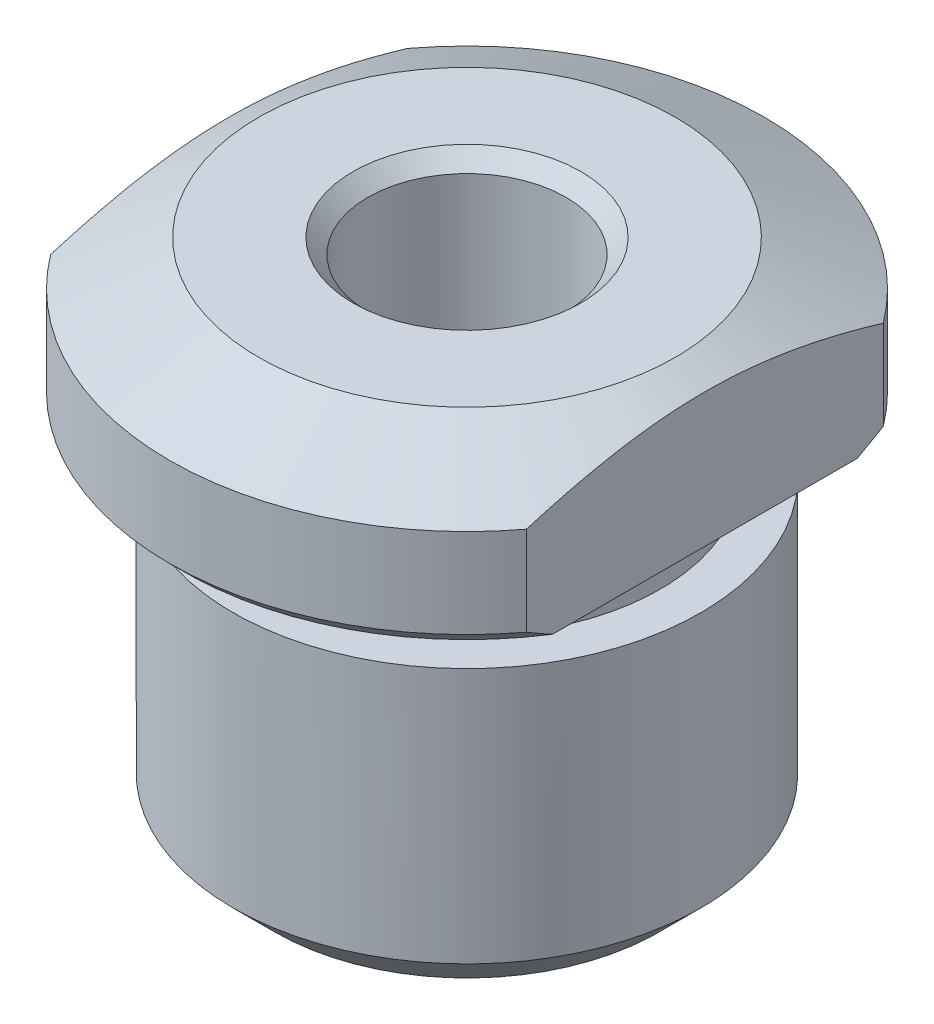
ISO-10303-21;
HEADER;
FILE_DESCRIPTION(('STEP AP214'),'2;1');
FILE_NAME('part.step','',(''),(''),'','','');
FILE_SCHEMA(('AUTOMOTIVE_DESIGN { 1 0 10303 214 1 1 1 1 }'));
ENDSEC;
DATA;
#1=APPLICATION_CONTEXT('core data for automotive mechanical design processes');
#2=APPLICATION_PROTOCOL_DEFINITION('international standard','automotive_design',2000,#1);
#3=PRODUCT_CONTEXT('',#1,'mechanical');
#4=PRODUCT('Part','Part','',(#3));
#5=PRODUCT_RELATED_PRODUCT_CATEGORY('part','',(#4));
#6=PRODUCT_DEFINITION_FORMATION('','',#4);
#7=PRODUCT_DEFINITION_CONTEXT('part definition',#1,'design');
#8=PRODUCT_DEFINITION('design','',#6,#7);
#9=PRODUCT_DEFINITION_SHAPE('','',#8);
#10=(LENGTH_UNIT() NAMED_UNIT(*) SI_UNIT(.MILLI.,.METRE.));
#11=(NAMED_UNIT(*) PLANE_ANGLE_UNIT() SI_UNIT($,.RADIAN.));
#12=(NAMED_UNIT(*) SI_UNIT($,.STERADIAN.) SOLID_ANGLE_UNIT());
#13=UNCERTAINTY_MEASURE_WITH_UNIT(LENGTH_MEASURE(1.E-05),#10,'distance_accuracy_value','');
#14=(GEOMETRIC_REPRESENTATION_CONTEXT(3) GLOBAL_UNCERTAINTY_ASSIGNED_CONTEXT((#13)) GLOBAL_UNIT_ASSIGNED_CONTEXT((#10,
#11,#12)) REPRESENTATION_CONTEXT('',''));
#15=CARTESIAN_POINT('',(0.,0.,0.));
#16=DIRECTION('',(0.,0.,1.));
#17=DIRECTION('',(1.,0.,0.));
#18=AXIS2_PLACEMENT_3D('',#15,#16,#17);
#19=CARTESIAN_POINT('',(3.5,8.5,0.));
#20=DIRECTION('',(0.,1.,0.));
#21=DIRECTION('',(0.,0.,1.));
#22=AXIS2_PLACEMENT_3D('',#19,#20,#21);
#23=PLANE('',#22);
#24=CARTESIAN_POINT('',(0.,8.49999999996953,0.));
#25=DIRECTION('',(0.,1.,0.));
#26=DIRECTION('',(0.,0.,1.));
#27=AXIS2_PLACEMENT_3D('',#24,#25,#26);
#28=CIRCLE('',#27,1.91599999999426);
#29=CARTESIAN_POINT('',(0.,8.49999999996953,1.91599999999426));
#30=VERTEX_POINT('',#29);
#31=EDGE_CURVE('E188',#30,#30,#28,.F.);
#32=ORIENTED_EDGE('',*,*,#31,.T.);
#33=EDGE_LOOP('',(#32));
#34=FACE_BOUND('',#33,.T.);
#35=CARTESIAN_POINT('',(0.,8.49999999996953,0.));
#36=DIRECTION('',(0.,-1.,0.));
#37=DIRECTION('',(0.,0.,-1.));
#38=AXIS2_PLACEMENT_3D('',#35,#36,#37);
#39=CIRCLE('',#38,3.50000000008777);
#40=CARTESIAN_POINT('',(0.,8.49999999996953,-3.50000000008777));
#41=VERTEX_POINT('',#40);
#42=EDGE_CURVE('E19',#41,#41,#39,.T.);
#43=ORIENTED_EDGE('',*,*,#42,.F.);
#44=EDGE_LOOP('',(#43));
#45=FACE_BOUND('',#44,.T.);
#46=ADVANCED_FACE('F16',(#34,#45),#23,.T.);
#47=CARTESIAN_POINT('',(0.,6.875,0.));
#48=DIRECTION('',(0.,-1.,0.));
#49=DIRECTION('',(0.,0.,-1.));
#50=AXIS2_PLACEMENT_3D('',#47,#48,#49);
#51=CYLINDRICAL_SURFACE('',#50,5.);
#52=CARTESIAN_POINT('',(0.,7.75000000001569,0.));
#53=DIRECTION('',(0.,-1.,0.));
#54=DIRECTION('',(1.,0.,0.));
#55=AXIS2_PLACEMENT_3D('',#52,#53,#54);
#56=CIRCLE('',#55,4.99999999999545);
#57=CARTESIAN_POINT('',(-4.,7.75000000002876,2.99999999999621));
#58=VERTEX_POINT('',#57);
#59=CARTESIAN_POINT('',(4.,7.75000000002876,2.99999999999621));
#60=VERTEX_POINT('',#59);
#61=EDGE_CURVE('E92',#58,#60,#56,.F.);
#62=ORIENTED_EDGE('',*,*,#61,.F.);
#63=DIRECTION('',(0.,-1.,0.));
#64=VECTOR('',#63,1.);
#65=CARTESIAN_POINT('',(-4.,6.875,3.));
#66=LINE('',#65,#64);
#67=CARTESIAN_POINT('',(-3.99999999999818,6.24999999991133,2.99999999999863));
#68=VERTEX_POINT('',#67);
#69=EDGE_CURVE('E63',#58,#68,#66,.T.);
#70=ORIENTED_EDGE('',*,*,#69,.T.);
#71=CARTESIAN_POINT('',(0.,6.24999999990905,0.));
#72=DIRECTION('',(0.,1.,0.));
#73=DIRECTION('',(1.,0.,0.));
#74=AXIS2_PLACEMENT_3D('',#71,#72,#73);
#75=CIRCLE('',#74,4.99999999999545);
#76=CARTESIAN_POINT('',(3.99999999999818,6.24999999991133,2.99999999999864));
#77=VERTEX_POINT('',#76);
#78=EDGE_CURVE('E84',#77,#68,#75,.F.);
#79=ORIENTED_EDGE('',*,*,#78,.F.);
#80=DIRECTION('',(0.,-1.,0.));
#81=VECTOR('',#80,1.);
#82=CARTESIAN_POINT('',(4.,6.875,3.));
#83=LINE('',#82,#81);
#84=EDGE_CURVE('E180',#77,#60,#83,.F.);
#85=ORIENTED_EDGE('',*,*,#84,.T.);
#86=EDGE_LOOP('',(#62,#70,#79,#85));
#87=FACE_BOUND('',#86,.T.);
#88=ADVANCED_FACE('F184',(#87),#51,.T.);
#89=CARTESIAN_POINT('',(0.,6.875,0.));
#90=DIRECTION('',(0.,-1.,0.));
#91=DIRECTION('',(0.,0.,-1.));
#92=AXIS2_PLACEMENT_3D('',#89,#90,#91);
#93=CYLINDRICAL_SURFACE('',#92,5.);
#94=CARTESIAN_POINT('',(0.,7.75000000001569,0.));
#95=DIRECTION('',(0.,-1.,0.));
#96=DIRECTION('',(1.,0.,0.));
#97=AXIS2_PLACEMENT_3D('',#94,#95,#96);
#98=CIRCLE('',#97,4.99999999999545);
#99=CARTESIAN_POINT('',(4.,7.75000000002876,-2.99999999999621));
#100=VERTEX_POINT('',#99);
#101=CARTESIAN_POINT('',(-4.,7.75000000002876,-2.99999999999621));
#102=VERTEX_POINT('',#101);
#103=EDGE_CURVE('E80',#100,#102,#98,.F.);
#104=ORIENTED_EDGE('',*,*,#103,.F.);
#105=DIRECTION('',(0.,-1.,0.));
#106=VECTOR('',#105,1.);
#107=CARTESIAN_POINT('',(4.,6.875,-3.));
#108=LINE('',#107,#106);
#109=CARTESIAN_POINT('',(3.99999999999818,6.24999999991133,-2.99999999999864));
#110=VERTEX_POINT('',#109);
#111=EDGE_CURVE('E89',#100,#110,#108,.T.);
#112=ORIENTED_EDGE('',*,*,#111,.T.);
#113=CARTESIAN_POINT('',(0.,6.24999999990905,0.));
#114=DIRECTION('',(0.,1.,0.));
#115=DIRECTION('',(1.,0.,0.));
#116=AXIS2_PLACEMENT_3D('',#113,#114,#115);
#117=CIRCLE('',#116,4.99999999999545);
#118=CARTESIAN_POINT('',(-3.99999999999818,6.24999999991133,-2.99999999999864));
#119=VERTEX_POINT('',#118);
#120=EDGE_CURVE('E82',#119,#110,#117,.F.);
#121=ORIENTED_EDGE('',*,*,#120,.F.);
#122=DIRECTION('',(0.,1.,0.));
#123=VECTOR('',#122,1.);
#124=CARTESIAN_POINT('',(-4.,8.5,-3.));
#125=LINE('',#124,#123);
#126=EDGE_CURVE('E69',#119,#102,#125,.T.);
#127=ORIENTED_EDGE('',*,*,#126,.T.);
#128=EDGE_LOOP('',(#104,#112,#121,#127));
#129=FACE_BOUND('',#128,.T.);
#130=ADVANCED_FACE('F78',(#129),#93,.T.);
#131=CARTESIAN_POINT('',(0.,7.75000000012938,0.));
#132=DIRECTION('',(0.,-1.,0.));
#133=DIRECTION('',(0.,0.,-1.));
#134=AXIS2_PLACEMENT_3D('',#131,#132,#133);
#135=CONICAL_SURFACE('',#134,4.99999999982492,1.10714871780925);
#136=ORIENTED_EDGE('',*,*,#42,.T.);
#137=EDGE_LOOP('',(#136));
#138=FACE_BOUND('',#137,.T.);
#139=ORIENTED_EDGE('',*,*,#61,.T.);
#140=CARTESIAN_POINT('',(4.,7.75000000003889,3.00000000000981));
#141=CARTESIAN_POINT('',(4.,7.79491387910037,2.85021935650481));
#142=CARTESIAN_POINT('',(4.,7.83789774873525,2.69982773216329));
#143=CARTESIAN_POINT('',(4.,7.91909856737556,2.39765556200096));
#144=CARTESIAN_POINT('',(4.,7.95731217030268,2.24587412051542));
#145=CARTESIAN_POINT('',(4.,8.02813930030492,1.94036449033213));
#146=CARTESIAN_POINT('',(4.,8.06073020936781,1.78663099267658));
#147=CARTESIAN_POINT('',(4.,8.11905342078394,1.47788703232964));
#148=CARTESIAN_POINT('',(4.,8.14478717362019,1.32287684685702));
#149=CARTESIAN_POINT('',(4.,8.1876823481098,1.01662399193388));
#150=CARTESIAN_POINT('',(4.,8.20508762998914,0.865415909072663));
#151=CARTESIAN_POINT('',(4.,8.23171542257041,0.56226673629436));
#152=CARTESIAN_POINT('',(4.,8.24093776512542,0.410325631379287));
#153=CARTESIAN_POINT('',(4.,8.25072427466178,0.106484775656386));
#154=CARTESIAN_POINT('',(4.,8.25130691579384,-0.0454143686751014));
#155=CARTESIAN_POINT('',(4.,8.24383512279487,-0.348982846789214));
#156=CARTESIAN_POINT('',(4.,8.23578125441728,-0.500652194973413));
#157=CARTESIAN_POINT('',(4.,8.20774356729911,-0.849158565101071));
#158=CARTESIAN_POINT('',(4.,8.18488577596153,-1.04576595544764));
#159=CARTESIAN_POINT('',(4.,8.12686623804992,-1.43731378677869));
#160=CARTESIAN_POINT('',(4.,8.09169168340674,-1.63225227527116));
#161=CARTESIAN_POINT('',(4.,8.01030918904255,-2.02419428553192));
#162=CARTESIAN_POINT('',(4.,7.96387858921217,-2.22115095905438));
#163=CARTESIAN_POINT('',(4.,7.88797064599536,-2.51470042351474));
#164=CARTESIAN_POINT('',(4.,7.86165634644429,-2.61213100309075));
#165=CARTESIAN_POINT('',(4.,7.80716669455936,-2.80645582780513));
#166=CARTESIAN_POINT('',(4.,7.77899161367512,-2.90335014894727));
#167=CARTESIAN_POINT('',(4.,7.75000000003889,-3.00000000000981));
#168=B_SPLINE_CURVE_WITH_KNOTS('',3,(#140,#141,#142,#143,#144,#145,#146,#147,#148,#149,#150,
#151,#152,#153,#154,#155,#156,#157,#158,#159,#160,#161,#162,#163,#164,#165,#166,#167),
.UNSPECIFIED.,.F.,.F.,(4,2,2,2,2,2,2,2,2,2,2,2,2,4),(0.,0.469142516963251,0.938612284087086,
1.40992861959039,1.88114517903748,2.33756137387622,2.79398694715405,3.24943641103924,
3.70485604153327,4.29817837779961,4.89211954489016,5.49893667869567,5.80168716653266,
6.10439358645555),.UNSPECIFIED.);
#169=EDGE_CURVE('E88',#60,#100,#168,.T.);
#170=ORIENTED_EDGE('',*,*,#169,.T.);
#171=ORIENTED_EDGE('',*,*,#103,.T.);
#172=CARTESIAN_POINT('',(-4.,7.75000000003889,-3.00000000000981));
#173=CARTESIAN_POINT('',(-4.,7.78694228888786,-2.87682334174033));
#174=CARTESIAN_POINT('',(-4.,7.82256593788984,-2.75325701851357));
#175=CARTESIAN_POINT('',(-4.,7.89069174720551,-2.50522260972994));
#176=CARTESIAN_POINT('',(-4.,7.92319281262515,-2.38075422420905));
#177=CARTESIAN_POINT('',(-4.,8.01546166788762,-2.00507052461318));
#178=CARTESIAN_POINT('',(-4.,8.06973040827052,-1.75243474662128));
#179=CARTESIAN_POINT('',(-4.,8.1360293926393,-1.37437723268489));
#180=CARTESIAN_POINT('',(-4.,8.15544089243393,-1.25023203806286));
#181=CARTESIAN_POINT('',(-4.,8.18916498930599,-1.00125660639436));
#182=CARTESIAN_POINT('',(-4.,8.20347825886983,-0.876426461904105));
#183=CARTESIAN_POINT('',(-4.,8.22654980461186,-0.626466193063438));
#184=CARTESIAN_POINT('',(-4.,8.23531758146342,-0.501336952443553));
#185=CARTESIAN_POINT('',(-4.,8.24704263493093,-0.250805138421694));
#186=CARTESIAN_POINT('',(-4.,8.25000000002289,-0.125402569210847));
#187=CARTESIAN_POINT('',(-4.,8.25000000002289,0.125402569210848));
#188=CARTESIAN_POINT('',(-4.,8.24704263493093,0.250805138421695));
#189=CARTESIAN_POINT('',(-4.,8.23531758146342,0.501336952443553));
#190=CARTESIAN_POINT('',(-4.,8.22654980461186,0.626466193063439));
#191=CARTESIAN_POINT('',(-4.,8.20347825886982,0.876426461904106));
#192=CARTESIAN_POINT('',(-4.,8.18916498930599,1.00125660639436));
#193=CARTESIAN_POINT('',(-4.,8.15544089243392,1.25023203806287));
#194=CARTESIAN_POINT('',(-4.,8.13602939263929,1.37437723268489));
#195=CARTESIAN_POINT('',(-4.,8.06973040827052,1.75243474662128));
#196=CARTESIAN_POINT('',(-4.,8.01546166788762,2.00507052461318));
#197=CARTESIAN_POINT('',(-4.,7.92319281262515,2.38075422420905));
#198=CARTESIAN_POINT('',(-4.,7.89069174720551,2.50522260972994));
#199=CARTESIAN_POINT('',(-4.,7.82256593788984,2.75325701851357));
#200=CARTESIAN_POINT('',(-4.,7.78694228888786,2.87682334174033));
#201=CARTESIAN_POINT('',(-4.,7.75000000003889,3.00000000000981));
#202=B_SPLINE_CURVE_WITH_KNOTS('',3,(#172,#173,#174,#175,#176,#177,#178,#179,#180,#181,#182,
#183,#184,#185,#186,#187,#188,#189,#190,#191,#192,#193,#194,#195,#196,#197,#198,#199,#200,#201),
.UNSPECIFIED.,.F.,.F.,(4,2,2,2,2,2,2,2,2,2,2,2,2,2,4),(0.,0.385766115623825,0.771667005293371,
1.54615966329038,1.92303597382833,2.29986255374942,2.67604178388624,3.05221528584135,
3.42838878779647,3.80456801793328,4.18139459785437,4.55827090839232,5.33276356638933,
5.71866445605888,6.1044305716827),.UNSPECIFIED.);
#203=EDGE_CURVE('E66',#102,#58,#202,.T.);
#204=ORIENTED_EDGE('',*,*,#203,.T.);
#205=EDGE_LOOP('',(#139,#170,#171,#204));
#206=FACE_BOUND('',#205,.T.);
#207=ADVANCED_FACE('F86',(#138,#206),#135,.T.);
#208=CARTESIAN_POINT('',(0.,8.49999999996953,0.));
#209=DIRECTION('',(0.,1.,0.));
#210=DIRECTION('',(0.,0.,1.));
#211=AXIS2_PLACEMENT_3D('',#208,#209,#210);
#212=CONICAL_SURFACE('',#211,1.91599999999426,0.785398163283761);
#213=CARTESIAN_POINT('',(0.,8.25,0.));
#214=DIRECTION('',(0.,-1.,0.));
#215=DIRECTION('',(0.,0.,-1.));
#216=AXIS2_PLACEMENT_3D('',#213,#214,#215);
#217=CIRCLE('',#216,1.666);
#218=CARTESIAN_POINT('',(0.,8.25,-1.666));
#219=VERTEX_POINT('',#218);
#220=EDGE_CURVE('E131',#219,#219,#217,.T.);
#221=ORIENTED_EDGE('',*,*,#220,.T.);
#222=EDGE_LOOP('',(#221));
#223=FACE_BOUND('',#222,.T.);
#224=ORIENTED_EDGE('',*,*,#31,.F.);
#225=EDGE_LOOP('',(#224));
#226=FACE_BOUND('',#225,.T.);
#227=ADVANCED_FACE('F141',(#223,#226),#212,.F.);
#228=CARTESIAN_POINT('',(0.,6.24999999990905,0.));
#229=DIRECTION('',(0.,1.,0.));
#230=DIRECTION('',(0.,0.,1.));
#231=AXIS2_PLACEMENT_3D('',#228,#229,#230);
#232=CONICAL_SURFACE('',#231,4.99999999999545,0.785398163397448);
#233=CARTESIAN_POINT('',(4.00000000003638,5.9999999999568,2.5617376915132));
#234=CARTESIAN_POINT('',(4.00000000143742,6.00972162154321,2.57976357906766));
#235=CARTESIAN_POINT('',(4.00000003164346,6.01949958778913,2.597759052207));
#236=CARTESIAN_POINT('',(4.00000011822165,6.03923737402845,2.63382291922614));
#237=CARTESIAN_POINT('',(4.00000017478543,6.04919800378297,2.65189086995705));
#238=CARTESIAN_POINT('',(4.00000028207004,6.06930109774479,2.68810142142043));
#239=CARTESIAN_POINT('',(4.00000033274426,6.07944436350451,2.70624357707125));
#240=CARTESIAN_POINT('',(4.00000040722288,6.09991274517778,2.7426042106637));
#241=CARTESIAN_POINT('',(4.00000043082314,6.11023865416713,2.76082224211374));
#242=CARTESIAN_POINT('',(4.00000044071544,6.13107232857173,2.79733624193925));
#243=CARTESIAN_POINT('',(4.00000042672496,6.141580878052,2.81563176289606));
#244=CARTESIAN_POINT('',(4.00000036507994,6.16277984512498,2.85230229965066));
#245=CARTESIAN_POINT('',(4.00000031717116,6.17347103741082,2.87067686755752));
#246=CARTESIAN_POINT('',(4.00000020587029,6.19503529218977,2.90750700154564));
#247=CARTESIAN_POINT('',(4.00000014236313,6.20590911958634,2.92596211969945));
#248=CARTESIAN_POINT('',(4.00000004099685,6.22783868225676,2.96295479873604));
#249=CARTESIAN_POINT('',(4.00000000333741,6.23889517262476,2.98149191202348));
#250=CARTESIAN_POINT('',(4.00000000003456,6.2499999999568,3.00000000002592));
#251=B_SPLINE_CURVE_WITH_KNOTS('',3,(#233,#234,#235,#236,#237,#238,#239,#240,#241,#242,#243,
#244,#245,#246,#247,#248,#249,#250),.UNSPECIFIED.,.F.,.F.,(4,2,2,2,2,2,2,2,4),(0.,
0.0614407552478923,0.12333532289982,0.185690498157925,0.248512831321725,0.311808633743947,
0.375583983804472,0.439844732886779,0.504596511342822),.UNSPECIFIED.);
#252=CARTESIAN_POINT('',(4.00000000001819,5.99999999993588,2.56173769150281));
#253=VERTEX_POINT('',#252);
#254=EDGE_CURVE('E121',#253,#77,#251,.T.);
#255=ORIENTED_EDGE('',*,*,#254,.T.);
#256=ORIENTED_EDGE('',*,*,#78,.T.);
#257=CARTESIAN_POINT('',(-4.00000000003456,6.2499999999568,3.00000000002592));
#258=CARTESIAN_POINT('',(-4.00000000333741,6.23889517262476,2.98149191202348));
#259=CARTESIAN_POINT('',(-4.00000004099685,6.22783868225676,2.96295479873604));
#260=CARTESIAN_POINT('',(-4.00000014236313,6.20590911958634,2.92596211969944));
#261=CARTESIAN_POINT('',(-4.0000002058703,6.19503529218976,2.90750700154563));
#262=CARTESIAN_POINT('',(-4.00000031717117,6.17347103741082,2.87067686755751));
#263=CARTESIAN_POINT('',(-4.00000036507994,6.16277984512498,2.85230229965065));
#264=CARTESIAN_POINT('',(-4.00000042672496,6.141580878052,2.81563176289605));
#265=CARTESIAN_POINT('',(-4.00000044071544,6.13107232857173,2.79733624193924));
#266=CARTESIAN_POINT('',(-4.00000043082314,6.11023865416713,2.76082224211374));
#267=CARTESIAN_POINT('',(-4.00000040722288,6.09991274517778,2.7426042106637));
#268=CARTESIAN_POINT('',(-4.00000033274426,6.07944436350451,2.70624357707125));
#269=CARTESIAN_POINT('',(-4.00000028207004,6.06930109774478,2.68810142142043));
#270=CARTESIAN_POINT('',(-4.00000017478543,6.04919800378297,2.65189086995705));
#271=CARTESIAN_POINT('',(-4.00000011822165,6.03923737402845,2.63382291922614));
#272=CARTESIAN_POINT('',(-4.00000003164345,6.01949958778913,2.597759052207));
#273=CARTESIAN_POINT('',(-4.00000000143742,6.00972162154321,2.57976357906766));
#274=CARTESIAN_POINT('',(-4.00000000003638,5.9999999999568,2.5617376915132));
#275=B_SPLINE_CURVE_WITH_KNOTS('',3,(#257,#258,#259,#260,#261,#262,#263,#264,#265,#266,#267,
#268,#269,#270,#271,#272,#273,#274),.UNSPECIFIED.,.F.,.F.,(4,2,2,2,2,2,2,2,4),(0.,
0.0647517784560482,0.129012527538358,0.192787877598882,0.256083680021102,0.318906013184901,
0.381261188443007,0.44315575609493,0.504596511342821),.UNSPECIFIED.);
#276=CARTESIAN_POINT('',(-4.00000000001819,5.99999999993588,2.56173769150281));
#277=VERTEX_POINT('',#276);
#278=EDGE_CURVE('E74',#68,#277,#275,.T.);
#279=ORIENTED_EDGE('',*,*,#278,.T.);
#280=CARTESIAN_POINT('',(0.,5.99999999991496,0.));
#281=DIRECTION('',(0.,1.,0.));
#282=DIRECTION('',(0.,0.,1.));
#283=AXIS2_PLACEMENT_3D('',#280,#281,#282);
#284=CIRCLE('',#283,4.75000000000136);
#285=EDGE_CURVE('E160',#253,#277,#284,.F.);
#286=ORIENTED_EDGE('',*,*,#285,.F.);
#287=EDGE_LOOP('',(#255,#256,#279,#286));
#288=FACE_BOUND('',#287,.T.);
#289=ADVANCED_FACE('F132',(#288),#232,.T.);
#290=CARTESIAN_POINT('',(-4.,8.5,-8.43013843384797));
#291=DIRECTION('',(1.,0.,0.));
#292=DIRECTION('',(0.,0.,-1.));
#293=AXIS2_PLACEMENT_3D('',#290,#291,#292);
#294=PLANE('',#293);
#295=ORIENTED_EDGE('',*,*,#69,.F.);
#296=ORIENTED_EDGE('',*,*,#203,.F.);
#297=ORIENTED_EDGE('',*,*,#126,.F.);
#298=CARTESIAN_POINT('',(-4.00000000000115,5.99999999991496,-2.56173769149064));
#299=CARTESIAN_POINT('',(-4.00000000140496,6.00972162150553,-2.57976357904847));
#300=CARTESIAN_POINT('',(-4.00000003161334,6.01949958775533,-2.59775905219132));
#301=CARTESIAN_POINT('',(-4.00000011819546,6.03923737400125,-2.63382291921645));
#302=CARTESIAN_POINT('',(-4.00000017476081,6.04919800375848,-2.65189086994986));
#303=CARTESIAN_POINT('',(-4.00000028204782,6.06930109772452,-2.68810142141717));
#304=CARTESIAN_POINT('',(-4.00000033272286,6.07944436348577,-2.70624357706943));
#305=CARTESIAN_POINT('',(-4.00000040720243,6.0999127451609,-2.74260421066369));
#306=CARTESIAN_POINT('',(-4.0000004308028,6.11023865415059,-2.7608222421141));
#307=CARTESIAN_POINT('',(-4.00000044069466,6.13107232855469,-2.79733624193923));
#308=CARTESIAN_POINT('',(-4.00000042670362,6.14158087803412,-2.81563176289531));
#309=CARTESIAN_POINT('',(-4.00000036505685,6.16277984510424,-2.8523022996473));
#310=CARTESIAN_POINT('',(-4.00000031714688,6.17347103738805,-2.8706768675523));
#311=CARTESIAN_POINT('',(-4.00000020584302,6.19503529216176,-2.90750700153553));
#312=CARTESIAN_POINT('',(-4.00000014233406,6.20590911955513,-2.92596211968633));
#313=CARTESIAN_POINT('',(-4.00000004096362,6.22783868221796,-2.96295479871569));
#314=CARTESIAN_POINT('',(-4.00000000330182,6.23889517258156,-2.98149191199893));
#315=CARTESIAN_POINT('',(-3.99999999999636,6.24999999990905,-2.99999999999727));
#316=B_SPLINE_CURVE_WITH_KNOTS('',3,(#298,#299,#300,#301,#302,#303,#304,#305,#306,#307,#308,
#309,#310,#311,#312,#313,#314,#315),.UNSPECIFIED.,.F.,.F.,(4,2,2,2,2,2,2,2,4),(0.,
0.0614407552627131,0.123335322925103,0.18569049818922,0.24851283135448,0.311808633773528,
0.375583983826164,0.439844732895784,0.504596511334258),.UNSPECIFIED.);
#317=CARTESIAN_POINT('',(-4.00000000000057,5.99999999991496,-2.56173769149153));
#318=VERTEX_POINT('',#317);
#319=EDGE_CURVE('E97',#318,#119,#316,.T.);
#320=ORIENTED_EDGE('',*,*,#319,.F.);
#321=DIRECTION('',(0.,0.,-1.));
#322=VECTOR('',#321,1.);
#323=CARTESIAN_POINT('',(-4.,6.,0.));
#324=LINE('',#323,#322);
#325=EDGE_CURVE('E163',#277,#318,#324,.T.);
#326=ORIENTED_EDGE('',*,*,#325,.F.);
#327=ORIENTED_EDGE('',*,*,#278,.F.);
#328=EDGE_LOOP('',(#295,#296,#297,#320,#326,#327));
#329=FACE_BOUND('',#328,.T.);
#330=ADVANCED_FACE('F68',(#329),#294,.F.);
#331=CARTESIAN_POINT('',(0.,6.24999999990905,0.));
#332=DIRECTION('',(0.,1.,0.));
#333=DIRECTION('',(0.,0.,1.));
#334=AXIS2_PLACEMENT_3D('',#331,#332,#333);
#335=CONICAL_SURFACE('',#334,4.99999999999545,0.785398163397448);
#336=ORIENTED_EDGE('',*,*,#319,.T.);
#337=ORIENTED_EDGE('',*,*,#120,.T.);
#338=CARTESIAN_POINT('',(4.00000000003456,6.2499999999568,-3.00000000002592));
#339=CARTESIAN_POINT('',(4.00000000333741,6.23889517262476,-2.98149191202348));
#340=CARTESIAN_POINT('',(4.00000004099685,6.22783868225676,-2.96295479873604));
#341=CARTESIAN_POINT('',(4.00000014236313,6.20590911958634,-2.92596211969945));
#342=CARTESIAN_POINT('',(4.0000002058703,6.19503529218977,-2.90750700154564));
#343=CARTESIAN_POINT('',(4.00000031717116,6.17347103741082,-2.87067686755752));
#344=CARTESIAN_POINT('',(4.00000036507994,6.16277984512498,-2.85230229965066));
#345=CARTESIAN_POINT('',(4.00000042672496,6.141580878052,-2.81563176289606));
#346=CARTESIAN_POINT('',(4.00000044071544,6.13107232857173,-2.79733624193925));
#347=CARTESIAN_POINT('',(4.00000043082314,6.11023865416713,-2.76082224211374));
#348=CARTESIAN_POINT('',(4.00000040722288,6.09991274517778,-2.7426042106637));
#349=CARTESIAN_POINT('',(4.00000033274426,6.07944436350451,-2.70624357707125));
#350=CARTESIAN_POINT('',(4.00000028207004,6.06930109774479,-2.68810142142044));
#351=CARTESIAN_POINT('',(4.00000017478543,6.04919800378297,-2.65189086995705));
#352=CARTESIAN_POINT('',(4.00000011822165,6.03923737402845,-2.63382291922614));
#353=CARTESIAN_POINT('',(4.00000003164346,6.01949958778913,-2.597759052207));
#354=CARTESIAN_POINT('',(4.00000000143742,6.00972162154322,-2.57976357906766));
#355=CARTESIAN_POINT('',(4.00000000003638,5.9999999999568,-2.5617376915132));
#356=B_SPLINE_CURVE_WITH_KNOTS('',3,(#338,#339,#340,#341,#342,#343,#344,#345,#346,#347,#348,
#349,#350,#351,#352,#353,#354,#355),.UNSPECIFIED.,.F.,.F.,(4,2,2,2,2,2,2,2,4),(0.,
0.0647517784560436,0.12901252753835,0.192787877598873,0.256083680021097,0.318906013184896,
0.381261188443001,0.44315575609493,0.504596511342822),.UNSPECIFIED.);
#357=CARTESIAN_POINT('',(4.00000000001819,5.99999999993588,-2.56173769150281));
#358=VERTEX_POINT('',#357);
#359=EDGE_CURVE('E34',#110,#358,#356,.T.);
#360=ORIENTED_EDGE('',*,*,#359,.T.);
#361=CARTESIAN_POINT('',(0.,5.99999999991496,0.));
#362=DIRECTION('',(0.,1.,0.));
#363=DIRECTION('',(0.,0.,1.));
#364=AXIS2_PLACEMENT_3D('',#361,#362,#363);
#365=CIRCLE('',#364,4.75000000000136);
#366=EDGE_CURVE('E164',#318,#358,#365,.F.);
#367=ORIENTED_EDGE('',*,*,#366,.F.);
#368=EDGE_LOOP('',(#336,#337,#360,#367));
#369=FACE_BOUND('',#368,.T.);
#370=ADVANCED_FACE('F104',(#369),#335,.T.);
#371=CARTESIAN_POINT('',(4.,8.5,8.43013843384797));
#372=DIRECTION('',(-1.,0.,0.));
#373=DIRECTION('',(0.,0.,1.));
#374=AXIS2_PLACEMENT_3D('',#371,#372,#373);
#375=PLANE('',#374);
#376=DIRECTION('',(0.,0.,-1.));
#377=VECTOR('',#376,1.);
#378=CARTESIAN_POINT('',(4.,6.,0.));
#379=LINE('',#378,#377);
#380=EDGE_CURVE('E167',#358,#253,#379,.F.);
#381=ORIENTED_EDGE('',*,*,#380,.F.);
#382=ORIENTED_EDGE('',*,*,#359,.F.);
#383=ORIENTED_EDGE('',*,*,#111,.F.);
#384=ORIENTED_EDGE('',*,*,#169,.F.);
#385=ORIENTED_EDGE('',*,*,#84,.F.);
#386=ORIENTED_EDGE('',*,*,#254,.F.);
#387=EDGE_LOOP('',(#381,#382,#383,#384,#385,#386));
#388=FACE_BOUND('',#387,.T.);
#389=ADVANCED_FACE('F114',(#388),#375,.F.);
#390=CARTESIAN_POINT('',(0.,3.5,0.));
#391=DIRECTION('',(0.,-1.,0.));
#392=DIRECTION('',(0.,0.,-1.));
#393=AXIS2_PLACEMENT_3D('',#390,#391,#392);
#394=CYLINDRICAL_SURFACE('',#393,1.666);
#395=CARTESIAN_POINT('',(0.,0.,0.));
#396=DIRECTION('',(0.,-1.,0.));
#397=DIRECTION('',(0.,0.,-1.));
#398=AXIS2_PLACEMENT_3D('',#395,#396,#397);
#399=CIRCLE('',#398,1.666);
#400=CARTESIAN_POINT('',(0.,0.,-1.666));
#401=VERTEX_POINT('',#400);
#402=EDGE_CURVE('E168',#401,#401,#399,.F.);
#403=ORIENTED_EDGE('',*,*,#402,.F.);
#404=EDGE_LOOP('',(#403));
#405=FACE_BOUND('',#404,.T.);
#406=ORIENTED_EDGE('',*,*,#220,.F.);
#407=EDGE_LOOP('',(#406));
#408=FACE_BOUND('',#407,.T.);
#409=ADVANCED_FACE('F206',(#405,#408),#394,.F.);
#410=CARTESIAN_POINT('',(3.25,6.,0.));
#411=DIRECTION('',(0.,-1.,0.));
#412=DIRECTION('',(0.,0.,-1.));
#413=AXIS2_PLACEMENT_3D('',#410,#411,#412);
#414=PLANE('',#413);
#415=CARTESIAN_POINT('',(0.,6.,0.));
#416=DIRECTION('',(0.,-1.,0.));
#417=DIRECTION('',(0.,0.,-1.));
#418=AXIS2_PLACEMENT_3D('',#415,#416,#417);
#419=CIRCLE('',#418,3.25);
#420=CARTESIAN_POINT('',(0.,6.,-3.25));
#421=VERTEX_POINT('',#420);
#422=EDGE_CURVE('E171',#421,#421,#419,.T.);
#423=ORIENTED_EDGE('',*,*,#422,.F.);
#424=EDGE_LOOP('',(#423));
#425=FACE_BOUND('',#424,.T.);
#426=ORIENTED_EDGE('',*,*,#366,.T.);
#427=ORIENTED_EDGE('',*,*,#380,.T.);
#428=ORIENTED_EDGE('',*,*,#285,.T.);
#429=ORIENTED_EDGE('',*,*,#325,.T.);
#430=EDGE_LOOP('',(#426,#427,#428,#429));
#431=FACE_BOUND('',#430,.T.);
#432=ADVANCED_FACE('F195',(#425,#431),#414,.T.);
#433=CARTESIAN_POINT('',(0.,0.,0.));
#434=DIRECTION('',(0.,-1.,0.));
#435=DIRECTION('',(0.,0.,-1.));
#436=AXIS2_PLACEMENT_3D('',#433,#434,#435);
#437=PLANE('',#436);
#438=ORIENTED_EDGE('',*,*,#402,.T.);
#439=EDGE_LOOP('',(#438));
#440=FACE_BOUND('',#439,.T.);
#441=CARTESIAN_POINT('',(0.,0.,0.));
#442=DIRECTION('',(0.,1.,0.));
#443=DIRECTION('',(0.,0.,1.));
#444=AXIS2_PLACEMENT_3D('',#441,#442,#443);
#445=CIRCLE('',#444,3.23299999990923);
#446=CARTESIAN_POINT('',(0.,0.,3.23299999990923));
#447=VERTEX_POINT('',#446);
#448=EDGE_CURVE('E174',#447,#447,#445,.T.);
#449=ORIENTED_EDGE('',*,*,#448,.F.);
#450=EDGE_LOOP('',(#449));
#451=FACE_BOUND('',#450,.T.);
#452=ADVANCED_FACE('F214',(#440,#451),#437,.T.);
#453=CARTESIAN_POINT('',(0.,5.5,0.));
#454=DIRECTION('',(0.,-1.,0.));
#455=DIRECTION('',(0.,0.,-1.));
#456=AXIS2_PLACEMENT_3D('',#453,#454,#455);
#457=CYLINDRICAL_SURFACE('',#456,3.25);
#458=ORIENTED_EDGE('',*,*,#422,.T.);
#459=EDGE_LOOP('',(#458));
#460=FACE_BOUND('',#459,.T.);
#461=CARTESIAN_POINT('',(0.,5.,0.));
#462=DIRECTION('',(0.,-1.,0.));
#463=DIRECTION('',(0.,0.,-1.));
#464=AXIS2_PLACEMENT_3D('',#461,#462,#463);
#465=CIRCLE('',#464,3.25);
#466=CARTESIAN_POINT('',(0.,5.,-3.25));
#467=VERTEX_POINT('',#466);
#468=EDGE_CURVE('E177',#467,#467,#465,.T.);
#469=ORIENTED_EDGE('',*,*,#468,.F.);
#470=EDGE_LOOP('',(#469));
#471=FACE_BOUND('',#470,.T.);
#472=ADVANCED_FACE('F233',(#460,#471),#457,.T.);
#473=CARTESIAN_POINT('',(0.,0.699999999994816,0.));
#474=DIRECTION('',(0.,1.,0.));
#475=DIRECTION('',(0.,0.,1.));
#476=AXIS2_PLACEMENT_3D('',#473,#474,#475);
#477=CONICAL_SURFACE('',#476,3.9329999998472,0.785398163356846);
#478=CARTESIAN_POINT('',(0.,0.7,0.));
#479=DIRECTION('',(0.,-1.,0.));
#480=DIRECTION('',(0.,0.,-1.));
#481=AXIS2_PLACEMENT_3D('',#478,#479,#480);
#482=CIRCLE('',#481,3.933);
#483=CARTESIAN_POINT('',(0.,0.7,-3.933));
#484=VERTEX_POINT('',#483);
#485=EDGE_CURVE('E25',#484,#484,#482,.F.);
#486=ORIENTED_EDGE('',*,*,#485,.F.);
#487=EDGE_LOOP('',(#486));
#488=FACE_BOUND('',#487,.T.);
#489=ORIENTED_EDGE('',*,*,#448,.T.);
#490=EDGE_LOOP('',(#489));
#491=FACE_BOUND('',#490,.T.);
#492=ADVANCED_FACE('F226',(#488,#491),#477,.T.);
#493=CARTESIAN_POINT('',(4.,5.,0.));
#494=DIRECTION('',(0.,1.,0.));
#495=DIRECTION('',(0.,0.,1.));
#496=AXIS2_PLACEMENT_3D('',#493,#494,#495);
#497=PLANE('',#496);
#498=ORIENTED_EDGE('',*,*,#468,.T.);
#499=EDGE_LOOP('',(#498));
#500=FACE_BOUND('',#499,.T.);
#501=CARTESIAN_POINT('',(0.,5.,0.));
#502=DIRECTION('',(0.,-1.,0.));
#503=DIRECTION('',(0.,0.,-1.));
#504=AXIS2_PLACEMENT_3D('',#501,#502,#503);
#505=CIRCLE('',#504,3.933);
#506=CARTESIAN_POINT('',(0.,5.,-3.933));
#507=VERTEX_POINT('',#506);
#508=EDGE_CURVE('E11',#507,#507,#505,.T.);
#509=ORIENTED_EDGE('',*,*,#508,.F.);
#510=EDGE_LOOP('',(#509));
#511=FACE_BOUND('',#510,.T.);
#512=ADVANCED_FACE('F220',(#500,#511),#497,.T.);
#513=CARTESIAN_POINT('',(0.,2.5,0.));
#514=DIRECTION('',(0.,-1.,0.));
#515=DIRECTION('',(0.,0.,-1.));
#516=AXIS2_PLACEMENT_3D('',#513,#514,#515);
#517=CYLINDRICAL_SURFACE('',#516,3.933);
#518=ORIENTED_EDGE('',*,*,#508,.T.);
#519=EDGE_LOOP('',(#518));
#520=FACE_BOUND('',#519,.T.);
#521=ORIENTED_EDGE('',*,*,#485,.T.);
#522=EDGE_LOOP('',(#521));
#523=FACE_BOUND('',#522,.T.);
#524=ADVANCED_FACE('F218',(#520,#523),#517,.T.);
#525=CLOSED_SHELL('',(#46,#88,#130,#207,#227,#289,#330,#370,#389,#409,#432,#452,#472,#492,#512,#524));
#526=MANIFOLD_SOLID_BREP('B1',#525);
#527=ADVANCED_BREP_SHAPE_REPRESENTATION('',(#18,#526),#14);
#528=SHAPE_DEFINITION_REPRESENTATION(#9,#527);
ENDSEC;
END-ISO-10303-21;
